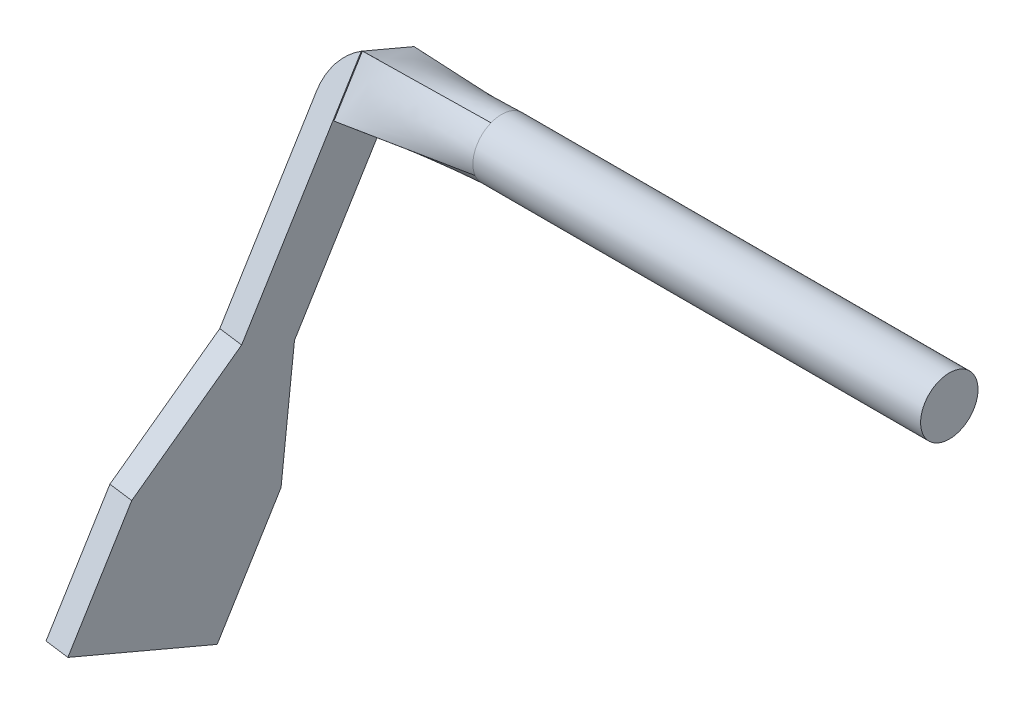
ISO-10303-21;
HEADER;
FILE_DESCRIPTION(('STEP AP214'),'2;1');
FILE_NAME('part.step','',(''),(''),'','','');
FILE_SCHEMA(('AUTOMOTIVE_DESIGN { 1 0 10303 214 1 1 1 1 }'));
ENDSEC;
DATA;
#1=APPLICATION_CONTEXT('core data for automotive mechanical design processes');
#2=APPLICATION_PROTOCOL_DEFINITION('international standard','automotive_design',2000,#1);
#3=PRODUCT_CONTEXT('',#1,'mechanical');
#4=PRODUCT('Part','Part','',(#3));
#5=PRODUCT_RELATED_PRODUCT_CATEGORY('part','',(#4));
#6=PRODUCT_DEFINITION_FORMATION('','',#4);
#7=PRODUCT_DEFINITION_CONTEXT('part definition',#1,'design');
#8=PRODUCT_DEFINITION('design','',#6,#7);
#9=PRODUCT_DEFINITION_SHAPE('','',#8);
#10=(LENGTH_UNIT() NAMED_UNIT(*) SI_UNIT(.MILLI.,.METRE.));
#11=(NAMED_UNIT(*) PLANE_ANGLE_UNIT() SI_UNIT($,.RADIAN.));
#12=(NAMED_UNIT(*) SI_UNIT($,.STERADIAN.) SOLID_ANGLE_UNIT());
#13=UNCERTAINTY_MEASURE_WITH_UNIT(LENGTH_MEASURE(1.E-05),#10,'distance_accuracy_value','');
#14=(GEOMETRIC_REPRESENTATION_CONTEXT(3) GLOBAL_UNCERTAINTY_ASSIGNED_CONTEXT((#13)) GLOBAL_UNIT_ASSIGNED_CONTEXT((#10,
#11,#12)) REPRESENTATION_CONTEXT('',''));
#15=CARTESIAN_POINT('',(0.,0.,0.));
#16=DIRECTION('',(0.,0.,1.));
#17=DIRECTION('',(1.,0.,0.));
#18=AXIS2_PLACEMENT_3D('',#15,#16,#17);
#19=CARTESIAN_POINT('',(-38.7890360234682,7.20091431639173,291.776424918787));
#20=DIRECTION('',(0.107904429239592,0.915130275715374,-0.388449755592125));
#21=DIRECTION('',(0.,0.390731128489271,0.920504853452442));
#22=AXIS2_PLACEMENT_3D('',#19,#20,#21);
#23=PLANE('',#22);
#24=DIRECTION('',(0.,0.390731128489271,0.920504853452441));
#25=VECTOR('',#24,1.);
#26=CARTESIAN_POINT('',(-36.8007134800658,7.00226121474362,291.860748157598));
#27=LINE('',#26,#25);
#28=CARTESIAN_POINT('',(-36.8007134800658,7.00226121474362,291.860748157598));
#29=VERTEX_POINT('',#28);
#30=CARTESIAN_POINT('',(-36.8007134800659,12.5228475029577,304.866434425422));
#31=VERTEX_POINT('',#30);
#32=EDGE_CURVE('E268',#29,#31,#27,.T.);
#33=ORIENTED_EDGE('',*,*,#32,.T.);
#34=DIRECTION('',(0.994161271701165,-0.099326550824059,0.0421616194057801));
#35=VECTOR('',#34,1.);
#36=CARTESIAN_POINT('',(-38.7890360234682,12.7215006046059,304.78211118661));
#37=LINE('',#36,#35);
#38=CARTESIAN_POINT('',(-38.7890360234682,12.7215006046059,304.78211118661));
#39=VERTEX_POINT('',#38);
#40=EDGE_CURVE('E271',#39,#31,#37,.T.);
#41=ORIENTED_EDGE('',*,*,#40,.F.);
#42=DIRECTION('',(0.,0.390731128489271,0.920504853452441));
#43=VECTOR('',#42,1.);
#44=CARTESIAN_POINT('',(-38.7890360234682,7.20091431639173,291.776424918787));
#45=LINE('',#44,#43);
#46=CARTESIAN_POINT('',(-38.7890360234682,7.20091431639173,291.776424918787));
#47=VERTEX_POINT('',#46);
#48=EDGE_CURVE('E291',#47,#39,#45,.T.);
#49=ORIENTED_EDGE('',*,*,#48,.F.);
#50=DIRECTION('',(0.994161271701165,-0.099326550824059,0.0421616194057801));
#51=VECTOR('',#50,1.);
#52=CARTESIAN_POINT('',(-38.7890360234682,7.20091431639173,291.776424918787));
#53=LINE('',#52,#51);
#54=EDGE_CURVE('E273',#47,#29,#53,.T.);
#55=ORIENTED_EDGE('',*,*,#54,.T.);
#56=EDGE_LOOP('',(#33,#41,#49,#55));
#57=FACE_BOUND('',#56,.T.);
#58=ADVANCED_FACE('F43',(#57),#23,.F.);
#59=CARTESIAN_POINT('',(-38.7890360234682,12.7215006046059,304.78211118661));
#60=DIRECTION('',(0.,-0.390731128489269,-0.920504853452442));
#61=DIRECTION('',(0.,0.920504853452442,-0.390731128489269));
#62=AXIS2_PLACEMENT_3D('',#59,#60,#61);
#63=PLANE('',#62);
#64=DIRECTION('',(0.107904429239593,0.915130275715375,-0.388449755592123));
#65=VECTOR('',#64,1.);
#66=CARTESIAN_POINT('',(-36.8007134800659,12.5228475029577,304.866434425422));
#67=LINE('',#66,#65);
#68=CARTESIAN_POINT('',(-35.5906103790929,22.785651284428,300.510132676487));
#69=VERTEX_POINT('',#68);
#70=EDGE_CURVE('E275',#31,#69,#67,.T.);
#71=ORIENTED_EDGE('',*,*,#70,.T.);
#72=DIRECTION('',(0.994161271701165,-0.099326550824059,0.0421616194057801));
#73=VECTOR('',#72,1.);
#74=CARTESIAN_POINT('',(-37.5789329224952,22.9843043860761,300.425809437675));
#75=LINE('',#74,#73);
#76=CARTESIAN_POINT('',(-37.5789329224952,22.9843043860761,300.425809437675));
#77=VERTEX_POINT('',#76);
#78=EDGE_CURVE('E302',#77,#69,#75,.T.);
#79=ORIENTED_EDGE('',*,*,#78,.F.);
#80=DIRECTION('',(0.107904429239593,0.915130275715375,-0.388449755592123));
#81=VECTOR('',#80,1.);
#82=CARTESIAN_POINT('',(-38.7890360234682,12.7215006046059,304.78211118661));
#83=LINE('',#82,#81);
#84=EDGE_CURVE('E321',#39,#77,#83,.T.);
#85=ORIENTED_EDGE('',*,*,#84,.F.);
#86=ORIENTED_EDGE('',*,*,#40,.T.);
#87=EDGE_LOOP('',(#71,#79,#85,#86));
#88=FACE_BOUND('',#87,.T.);
#89=ADVANCED_FACE('F255',(#88),#63,.F.);
#90=CARTESIAN_POINT('',(-37.5789329224952,22.9843043860761,300.425809437675));
#91=DIRECTION('',(-0.041952753403164,-0.715788508678569,-0.697055792118252));
#92=DIRECTION('',(0.,0.69767002381762,-0.71641924727517));
#93=AXIS2_PLACEMENT_3D('',#90,#91,#92);
#94=PLANE('',#93);
#95=DIRECTION('',(0.0994149502409748,0.691217076716936,-0.715776236350075));
#96=VECTOR('',#95,1.);
#97=CARTESIAN_POINT('',(-35.5906103790929,22.785651284428,300.510132676487));
#98=LINE('',#97,#96);
#99=CARTESIAN_POINT('',(-34.4234859486809,30.9004905012534,292.106970675927));
#100=VERTEX_POINT('',#99);
#101=EDGE_CURVE('E278',#69,#100,#98,.T.);
#102=ORIENTED_EDGE('',*,*,#101,.T.);
#103=DIRECTION('',(0.994161271701165,-0.099326550824059,0.0421616194057801));
#104=VECTOR('',#103,1.);
#105=CARTESIAN_POINT('',(-36.411808492083,31.0991436029038,292.022647437114));
#106=LINE('',#105,#104);
#107=CARTESIAN_POINT('',(-36.411808492083,31.0991436029038,292.022647437114));
#108=VERTEX_POINT('',#107);
#109=EDGE_CURVE('E299',#108,#100,#106,.T.);
#110=ORIENTED_EDGE('',*,*,#109,.F.);
#111=DIRECTION('',(0.0994149502409748,0.691217076716936,-0.715776236350075));
#112=VECTOR('',#111,1.);
#113=CARTESIAN_POINT('',(-37.5789329224952,22.9843043860761,300.425809437675));
#114=LINE('',#113,#112);
#115=EDGE_CURVE('E323',#77,#108,#114,.T.);
#116=ORIENTED_EDGE('',*,*,#115,.F.);
#117=ORIENTED_EDGE('',*,*,#78,.T.);
#118=EDGE_LOOP('',(#102,#110,#116,#117));
#119=FACE_BOUND('',#118,.T.);
#120=ADVANCED_FACE('F251',(#119),#94,.F.);
#121=CARTESIAN_POINT('',(-37.5789329224951,17.463718097862,287.420123169852));
#122=DIRECTION('',(-0.0419527534031707,0.00419149529530913,0.999110803589413));
#123=DIRECTION('',(0.99911958021048,0.,0.0419531219342866));
#124=AXIS2_PLACEMENT_3D('',#121,#122,#123);
#125=PLANE('',#124);
#126=DIRECTION('',(-0.0994149502409721,-0.995046063088833,0.));
#127=VECTOR('',#126,1.);
#128=CARTESIAN_POINT('',(-35.5906103790928,17.2650649962139,287.504446408663));
#129=LINE('',#128,#127);
#130=CARTESIAN_POINT('',(-34.4234859486806,28.9468348588093,287.504446408663));
#131=VERTEX_POINT('',#130);
#132=CARTESIAN_POINT('',(-35.5906103790928,17.2650649962139,287.504446408663));
#133=VERTEX_POINT('',#132);
#134=EDGE_CURVE('E287',#131,#133,#129,.T.);
#135=ORIENTED_EDGE('',*,*,#134,.T.);
#136=DIRECTION('',(0.994161271701165,-0.099326550824059,0.0421616194057801));
#137=VECTOR('',#136,1.);
#138=CARTESIAN_POINT('',(-37.5789329224951,17.463718097862,287.420123169852));
#139=LINE('',#138,#137);
#140=CARTESIAN_POINT('',(-37.5789329224951,17.463718097862,287.420123169852));
#141=VERTEX_POINT('',#140);
#142=EDGE_CURVE('E293',#141,#133,#139,.T.);
#143=ORIENTED_EDGE('',*,*,#142,.F.);
#144=DIRECTION('',(-0.0994149502409721,-0.995046063088833,0.));
#145=VECTOR('',#144,1.);
#146=CARTESIAN_POINT('',(-37.5789329224951,17.463718097862,287.420123169852));
#147=LINE('',#146,#145);
#148=CARTESIAN_POINT('',(-36.411808492083,29.1454879604574,287.420123169852));
#149=VERTEX_POINT('',#148);
#150=EDGE_CURVE('E325',#149,#141,#147,.T.);
#151=ORIENTED_EDGE('',*,*,#150,.F.);
#152=DIRECTION('',(0.994161271701165,-0.099326550824059,0.0421616194057801));
#153=VECTOR('',#152,1.);
#154=CARTESIAN_POINT('',(-36.411808492083,29.1454879604574,287.420123169852));
#155=LINE('',#154,#153);
#156=EDGE_CURVE('E296',#149,#131,#155,.T.);
#157=ORIENTED_EDGE('',*,*,#156,.T.);
#158=EDGE_LOOP('',(#135,#143,#151,#157));
#159=FACE_BOUND('',#158,.T.);
#160=ADVANCED_FACE('F247',(#159),#125,.F.);
#161=CARTESIAN_POINT('',(-37.5789329224951,17.463718097862,287.420123169852));
#162=DIRECTION('',(0.,0.390731128489269,0.920504853452442));
#163=DIRECTION('',(0.,-0.920504853452442,0.390731128489269));
#164=AXIS2_PLACEMENT_3D('',#161,#162,#163);
#165=PLANE('',#164);
#166=DIRECTION('',(-0.107904429239592,-0.915130275715375,0.388449755592122));
#167=VECTOR('',#166,1.);
#168=CARTESIAN_POINT('',(-35.5906103790928,17.2650649962139,287.504446408663));
#169=LINE('',#168,#167);
#170=EDGE_CURVE('E289',#133,#29,#169,.T.);
#171=ORIENTED_EDGE('',*,*,#170,.T.);
#172=ORIENTED_EDGE('',*,*,#54,.F.);
#173=DIRECTION('',(-0.107904429239592,-0.915130275715375,0.388449755592122));
#174=VECTOR('',#173,1.);
#175=CARTESIAN_POINT('',(-37.5789329224951,17.463718097862,287.420123169852));
#176=LINE('',#175,#174);
#177=EDGE_CURVE('E283',#141,#47,#176,.T.);
#178=ORIENTED_EDGE('',*,*,#177,.F.);
#179=ORIENTED_EDGE('',*,*,#142,.T.);
#180=EDGE_LOOP('',(#171,#172,#178,#179));
#181=FACE_BOUND('',#180,.T.);
#182=ADVANCED_FACE('F240',(#181),#165,.F.);
#183=CARTESIAN_POINT('',(-26.818527057969,2.67943629134899,-1.13735322731581));
#184=DIRECTION('',(-0.994161271701165,0.0993265508240592,-0.0421616194057804));
#185=DIRECTION('',(-0.0994149502409721,-0.995046063088833,0.));
#186=AXIS2_PLACEMENT_3D('',#183,#184,#185);
#187=PLANE('',#186);
#188=DIRECTION('',(-0.107904429239593,-0.915130275715377,0.388449755592118));
#189=VECTOR('',#188,1.);
#190=CARTESIAN_POINT('',(-34.1458154780518,50.3168793929244,283.86520256968));
#191=LINE('',#190,#189);
#192=CARTESIAN_POINT('',(-34.5774331950102,46.6563582900629,285.419001592049));
#193=VERTEX_POINT('',#192);
#194=EDGE_CURVE('E358',#193,#108,#191,.T.);
#195=ORIENTED_EDGE('',*,*,#194,.F.);
#196=DIRECTION('',(0.,-0.390731128489268,-0.920504853452443));
#197=VECTOR('',#196,1.);
#198=CARTESIAN_POINT('',(-34.5774331950102,44.7027026476166,280.816477324787));
#199=LINE('',#198,#197);
#200=CARTESIAN_POINT('',(-34.5774331950102,44.7027026476166,280.816477324787));
#201=VERTEX_POINT('',#200);
#202=EDGE_CURVE('E54',#193,#201,#199,.T.);
#203=ORIENTED_EDGE('',*,*,#202,.T.);
#204=DIRECTION('',(-0.107904429239593,-0.915130275715377,0.388449755592118));
#205=VECTOR('',#204,1.);
#206=CARTESIAN_POINT('',(-34.1458154780518,48.3632237504781,279.262678302418));
#207=LINE('',#206,#205);
#208=EDGE_CURVE('E312',#201,#149,#207,.T.);
#209=ORIENTED_EDGE('',*,*,#208,.T.);
#210=ORIENTED_EDGE('',*,*,#150,.T.);
#211=ORIENTED_EDGE('',*,*,#177,.T.);
#212=ORIENTED_EDGE('',*,*,#48,.T.);
#213=ORIENTED_EDGE('',*,*,#84,.T.);
#214=ORIENTED_EDGE('',*,*,#115,.T.);
#215=EDGE_LOOP('',(#195,#203,#209,#210,#211,#212,#213,#214));
#216=FACE_BOUND('',#215,.T.);
#217=ADVANCED_FACE('F237',(#216),#187,.T.);
#218=CARTESIAN_POINT('',(-24.8302045145666,2.48078318970087,-1.05302998850425));
#219=DIRECTION('',(-0.994161271701165,0.0993265508240592,-0.0421616194057804));
#220=DIRECTION('',(-0.0994149502409721,-0.995046063088833,0.));
#221=AXIS2_PLACEMENT_3D('',#218,#219,#220);
#222=PLANE('',#221);
#223=DIRECTION('',(0.,-0.390731128489274,-0.92050485345244));
#224=VECTOR('',#223,1.);
#225=CARTESIAN_POINT('',(-32.6970150808475,45.5011549177807,285.794195193431));
#226=LINE('',#225,#224);
#227=CARTESIAN_POINT('',(-32.6970150808475,45.5011549177807,285.794195193431));
#228=VERTEX_POINT('',#227);
#229=CARTESIAN_POINT('',(-32.6970150808475,43.5889192702531,281.289250319191));
#230=VERTEX_POINT('',#229);
#231=EDGE_CURVE('E343',#228,#230,#226,.T.);
#232=ORIENTED_EDGE('',*,*,#231,.F.);
#233=DIRECTION('',(-0.107904429239594,-0.915130275715374,0.388449755592123));
#234=VECTOR('',#233,1.);
#235=CARTESIAN_POINT('',(-32.1574929346495,50.0768062963576,283.85194641547));
#236=LINE('',#235,#234);
#237=CARTESIAN_POINT('',(-32.1574929346495,50.0768062963576,283.85194641547));
#238=VERTEX_POINT('',#237);
#239=EDGE_CURVE('E346',#238,#228,#236,.T.);
#240=ORIENTED_EDGE('',*,*,#239,.F.);
#241=DIRECTION('',(0.,-0.390731128489268,-0.920504853452443));
#242=VECTOR('',#241,1.);
#243=CARTESIAN_POINT('',(-32.1574929346495,50.1182262912763,283.949525808492));
#244=LINE('',#243,#242);
#245=CARTESIAN_POINT('',(-32.1574929346495,50.1182262912763,283.949525808492));
#246=VERTEX_POINT('',#245);
#247=EDGE_CURVE('E140',#246,#238,#244,.T.);
#248=ORIENTED_EDGE('',*,*,#247,.F.);
#249=DIRECTION('',(-0.107904429239593,-0.915130275715377,0.388449755592118));
#250=VECTOR('',#249,1.);
#251=CARTESIAN_POINT('',(-32.1574929346495,50.1182262912763,283.949525808492));
#252=LINE('',#251,#250);
#253=EDGE_CURVE('E276',#246,#100,#252,.T.);
#254=ORIENTED_EDGE('',*,*,#253,.T.);
#255=ORIENTED_EDGE('',*,*,#101,.F.);
#256=ORIENTED_EDGE('',*,*,#70,.F.);
#257=ORIENTED_EDGE('',*,*,#32,.F.);
#258=ORIENTED_EDGE('',*,*,#170,.F.);
#259=ORIENTED_EDGE('',*,*,#134,.F.);
#260=DIRECTION('',(-0.107904429239593,-0.915130275715377,0.388449755592118));
#261=VECTOR('',#260,1.);
#262=CARTESIAN_POINT('',(-32.1574929346495,48.16457064883,279.34700154123));
#263=LINE('',#262,#261);
#264=EDGE_CURVE('E309',#230,#131,#263,.T.);
#265=ORIENTED_EDGE('',*,*,#264,.F.);
#266=EDGE_LOOP('',(#232,#240,#248,#254,#255,#256,#257,#258,#259,#265));
#267=FACE_BOUND('',#266,.T.);
#268=ADVANCED_FACE('F235',(#267),#222,.F.);
#269=CARTESIAN_POINT('',(-34.1458154780518,50.3168793929244,283.86520256968));
#270=DIRECTION('',(0.,-0.390731128489266,-0.920504853452444));
#271=DIRECTION('',(0.,0.920504853452444,-0.390731128489266));
#272=AXIS2_PLACEMENT_3D('',#269,#270,#271);
#273=PLANE('',#272);
#274=ORIENTED_EDGE('',*,*,#253,.F.);
#275=CARTESIAN_POINT('',(-29.6066268365044,46.1597255359426,285.629809689078));
#276=DIRECTION('',(0.,-0.390731128489266,-0.920504853452444));
#277=DIRECTION('',(0.,0.920504853452444,-0.390731128489266));
#278=AXIS2_PLACEMENT_3D('',#275,#276,#277);
#279=CIRCLE('',#278,5.);
#280=EDGE_CURVE('E306',#246,#193,#279,.F.);
#281=ORIENTED_EDGE('',*,*,#280,.T.);
#282=ORIENTED_EDGE('',*,*,#194,.T.);
#283=ORIENTED_EDGE('',*,*,#109,.T.);
#284=EDGE_LOOP('',(#274,#281,#282,#283));
#285=FACE_BOUND('',#284,.T.);
#286=ADVANCED_FACE('F231',(#285),#273,.F.);
#287=CARTESIAN_POINT('',(-32.1574929346495,48.16457064883,279.34700154123));
#288=DIRECTION('',(0.,0.390731128489263,0.920504853452445));
#289=DIRECTION('',(0.,-0.920504853452445,0.390731128489263));
#290=AXIS2_PLACEMENT_3D('',#287,#288,#289);
#291=PLANE('',#290);
#292=ORIENTED_EDGE('',*,*,#208,.F.);
#293=CARTESIAN_POINT('',(-29.6066268365043,44.2060698934962,281.027285421816));
#294=DIRECTION('',(0.,0.390731128489263,0.920504853452445));
#295=DIRECTION('',(0.,-0.920504853452445,0.390731128489263));
#296=AXIS2_PLACEMENT_3D('',#293,#294,#295);
#297=CIRCLE('',#296,5.);
#298=CARTESIAN_POINT('',(-32.1574929346491,48.16457064883,279.34700154123));
#299=VERTEX_POINT('',#298);
#300=EDGE_CURVE('E11',#201,#299,#297,.F.);
#301=ORIENTED_EDGE('',*,*,#300,.T.);
#302=DIRECTION('',(-0.107904429239592,-0.915130275715377,0.388449755592118));
#303=VECTOR('',#302,1.);
#304=CARTESIAN_POINT('',(-32.1574929346495,48.16457064883,279.34700154123));
#305=LINE('',#304,#303);
#306=EDGE_CURVE('E151',#299,#230,#305,.T.);
#307=ORIENTED_EDGE('',*,*,#306,.T.);
#308=ORIENTED_EDGE('',*,*,#264,.T.);
#309=ORIENTED_EDGE('',*,*,#156,.F.);
#310=EDGE_LOOP('',(#292,#301,#307,#308,#309));
#311=FACE_BOUND('',#310,.T.);
#312=ADVANCED_FACE('F223',(#311),#291,.F.);
#313=CARTESIAN_POINT('',(-29.6066268365032,-63.6199625074653,27.0050718926178));
#314=DIRECTION('',(0.,0.390731128489268,0.920504853452442));
#315=DIRECTION('',(0.,-0.920504853452443,0.390731128489269));
#316=AXIS2_PLACEMENT_3D('',#313,#314,#315);
#317=CYLINDRICAL_SURFACE('',#316,5.);
#318=ORIENTED_EDGE('',*,*,#300,.F.);
#319=ORIENTED_EDGE('',*,*,#202,.F.);
#320=ORIENTED_EDGE('',*,*,#280,.F.);
#321=ORIENTED_EDGE('',*,*,#247,.T.);
#322=DIRECTION('',(0.,0.390731128489231,0.920504853452459));
#323=VECTOR('',#322,1.);
#324=CARTESIAN_POINT('',(-32.1574929346495,50.0768062963576,283.85194641547));
#325=LINE('',#324,#323);
#326=EDGE_CURVE('E345',#299,#238,#325,.T.);
#327=ORIENTED_EDGE('',*,*,#326,.F.);
#328=EDGE_LOOP('',(#318,#319,#320,#321,#327));
#329=FACE_BOUND('',#328,.T.);
#330=ADVANCED_FACE('F45',(#329),#317,.T.);
#331=CARTESIAN_POINT('',(-32.1574929346495,50.0768062963576,283.85194641547));
#332=CARTESIAN_POINT('',(-21.5,49.7232134337961,283.306718550008));
#333=CARTESIAN_POINT('',(-32.2024531134994,49.6955020148095,284.0138004803));
#334=CARTESIAN_POINT('',(-21.5,49.6141347701034,283.582869143137));
#335=CARTESIAN_POINT('',(-32.2474132923492,49.3141977332614,284.17565454513));
#336=CARTESIAN_POINT('',(-21.5,49.445536510252,283.861201019409));
#337=CARTESIAN_POINT('',(-32.3373336500489,48.5515891701652,284.499362674791));
#338=CARTESIAN_POINT('',(-21.5,48.9865603511272,284.347450111115));
#339=CARTESIAN_POINT('',(-32.3822938288987,48.1702848886171,284.661216739621));
#340=CARTESIAN_POINT('',(-21.5,48.6961023492884,284.553181607394));
#341=CARTESIAN_POINT('',(-32.4722141865984,47.407676325521,284.984924869281));
#342=CARTESIAN_POINT('',(-21.5,48.0536174000272,284.825900288149));
#343=CARTESIAN_POINT('',(-32.5171743654482,47.0263720439729,285.146778934111));
#344=CARTESIAN_POINT('',(-21.5,47.7038574643261,284.891925183241));
#345=CARTESIAN_POINT('',(-32.6070947231478,46.2637634808768,285.470487063771));
#346=CARTESIAN_POINT('',(-21.5,47.035247509006,284.884308000225));
#347=CARTESIAN_POINT('',(-32.6520549019977,45.8824591993287,285.632341128601));
#348=CARTESIAN_POINT('',(-21.5,46.7179141202506,284.812241871186));
#349=CARTESIAN_POINT('',(-32.6970150808475,45.5011549177807,285.794195193431));
#350=CARTESIAN_POINT('',(-21.5,46.4434956009533,284.698876174324));
#351=B_SPLINE_SURFACE_WITH_KNOTS('',3,1,((#331,#332),(#333,#334),(#335,#336),(#337,#338),(#339,
#340),(#341,#342),(#343,#344),(#345,#346),(#347,#348),(#349,#350)),.UNSPECIFIED.,.F.,.F.,.F.,(4,
2,2,2,4),(2,2),(0.,0.25,0.5,0.75,1.),(0.,1.),.UNSPECIFIED.);
#352=DIRECTION('',(0.991776498634803,0.0834679007333563,-0.0970179689689347));
#353=VECTOR('',#352,1.);
#354=CARTESIAN_POINT('',(-27.0985075404237,45.972325259367,285.246535683877));
#355=LINE('',#354,#353);
#356=CARTESIAN_POINT('',(-21.5,46.4434956009533,284.698876174324));
#357=VERTEX_POINT('',#356);
#358=EDGE_CURVE('E62',#228,#357,#355,.T.);
#359=CARTESIAN_POINT('',(-21.5,47.3980320534347,282.388278814141));
#360=DIRECTION('',(1.,0.,0.));
#361=DIRECTION('',(0.,0.,-1.));
#362=AXIS2_PLACEMENT_3D('',#359,#360,#361);
#363=CIRCLE('',#362,2.50000000000002);
#364=CARTESIAN_POINT('',(-21.5,49.7232240685998,283.306722770029));
#365=VERTEX_POINT('',#364);
#366=EDGE_CURVE('E47',#365,#357,#363,.T.);
#367=DIRECTION('',(-0.998146155191497,0.0331163584562606,0.051064270082204));
#368=VECTOR('',#367,1.);
#369=CARTESIAN_POINT('',(-26.8287464673248,49.9000098650768,283.579332482739));
#370=LINE('',#369,#368);
#371=EDGE_CURVE('E135',#365,#238,#370,.T.);
#372=ORIENTED_EDGE('',*,*,#239,.T.);
#373=ORIENTED_EDGE('',*,*,#358,.T.);
#374=ORIENTED_EDGE('',*,*,#366,.F.);
#375=ORIENTED_EDGE('',*,*,#371,.T.);
#376=EDGE_LOOP('',(#372,#373,#374,#375));
#377=FACE_BOUND('',#376,.T.);
#378=ADVANCED_FACE('F180',(#377),#351,.T.);
#379=CARTESIAN_POINT('',(-32.6970150808475,45.5011549177807,285.794195193431));
#380=CARTESIAN_POINT('',(-21.5,46.4434956009533,284.698876174324));
#381=CARTESIAN_POINT('',(-32.6970150808475,45.3418019471533,285.418783120577));
#382=CARTESIAN_POINT('',(-21.5,46.173317608877,284.587262291897));
#383=CARTESIAN_POINT('',(-32.6970150808475,45.1824489765259,285.043371047724));
#384=CARTESIAN_POINT('',(-21.5,45.9024321265087,284.418186906408));
#385=CARTESIAN_POINT('',(-32.6970150808475,44.8637430352713,284.292546902017));
#386=CARTESIAN_POINT('',(-21.5,45.4298651710489,283.964243638479));
#387=CARTESIAN_POINT('',(-32.6970150808475,44.7043900646439,283.917134829164));
#388=CARTESIAN_POINT('',(-21.5,45.2301589238934,283.679351436224));
#389=CARTESIAN_POINT('',(-32.6970150808475,44.3856841233893,283.166310683457));
#390=CARTESIAN_POINT('',(-21.5,44.9633809157137,283.050861834504));
#391=CARTESIAN_POINT('',(-32.6970150808475,44.2263311527621,282.790898610603));
#392=CARTESIAN_POINT('',(-21.5,44.8971742320447,282.709302429574));
#393=CARTESIAN_POINT('',(-32.6970150808475,43.9076252115075,282.040074464897));
#394=CARTESIAN_POINT('',(-21.5,44.8989073635404,282.054030719406));
#395=CARTESIAN_POINT('',(-32.6970150808475,43.7482722408803,281.664662392044));
#396=CARTESIAN_POINT('',(-21.5,44.9654575772635,281.741722378836));
#397=CARTESIAN_POINT('',(-32.6970150808475,43.5889192702531,281.289250319191));
#398=CARTESIAN_POINT('',(-21.5,45.0728506730732,281.469839078273));
#399=B_SPLINE_SURFACE_WITH_KNOTS('',3,1,((#379,#380),(#381,#382),(#383,#384),(#385,#386),(#387,
#388),(#389,#390),(#391,#392),(#393,#394),(#395,#396),(#397,#398)),.UNSPECIFIED.,.F.,.F.,.F.,(4,
2,2,2,4),(2,2),(0.,0.25,0.5,0.75,1.),(0.,1.),.UNSPECIFIED.);
#400=DIRECTION('',(0.991205339850088,0.131363646456324,0.0159864518380181));
#401=VECTOR('',#400,1.);
#402=CARTESIAN_POINT('',(-27.0985075404237,44.3308849716631,281.379544698732));
#403=LINE('',#402,#401);
#404=CARTESIAN_POINT('',(-21.5,45.0728400382662,281.469834858251));
#405=VERTEX_POINT('',#404);
#406=EDGE_CURVE('E152',#230,#405,#403,.T.);
#407=EDGE_CURVE('E158',#357,#405,#363,.T.);
#408=ORIENTED_EDGE('',*,*,#231,.T.);
#409=ORIENTED_EDGE('',*,*,#406,.T.);
#410=ORIENTED_EDGE('',*,*,#407,.F.);
#411=ORIENTED_EDGE('',*,*,#358,.F.);
#412=EDGE_LOOP('',(#408,#409,#410,#411));
#413=FACE_BOUND('',#412,.T.);
#414=ADVANCED_FACE('F186',(#413),#399,.T.);
#415=CARTESIAN_POINT('',(-32.1574929346495,48.1645706488301,279.34700154123));
#416=CARTESIAN_POINT('',(-21.5,48.352568505916,280.077681453958));
#417=CARTESIAN_POINT('',(-32.1574929346495,48.3239236194574,279.722413614083));
#418=CARTESIAN_POINT('',(-21.5,48.6227464979923,280.189295336385));
#419=CARTESIAN_POINT('',(-32.1574929346495,48.4832765900847,280.097825686937));
#420=CARTESIAN_POINT('',(-21.5,48.8936319803606,280.358370721874));
#421=CARTESIAN_POINT('',(-32.1574929346495,48.8019825313393,280.848649832643));
#422=CARTESIAN_POINT('',(-21.5,49.3661989358205,280.812313989802));
#423=CARTESIAN_POINT('',(-32.1574929346495,48.9613355019666,281.224061905497));
#424=CARTESIAN_POINT('',(-21.5,49.565905182976,281.097206192058));
#425=CARTESIAN_POINT('',(-32.1574929346495,49.2800414432211,281.974886051203));
#426=CARTESIAN_POINT('',(-21.5,49.8326831911556,281.725695793778));
#427=CARTESIAN_POINT('',(-32.1574929346495,49.4393944138484,282.350298124057));
#428=CARTESIAN_POINT('',(-21.5,49.8988898748246,282.067255198708));
#429=CARTESIAN_POINT('',(-32.1574929346495,49.758100355103,283.101122269764));
#430=CARTESIAN_POINT('',(-21.5,49.8971567433289,282.722526908875));
#431=CARTESIAN_POINT('',(-32.1574929346495,49.9174533257303,283.476534342617));
#432=CARTESIAN_POINT('',(-21.5,49.8306065296058,283.034835249445));
#433=CARTESIAN_POINT('',(-32.1574929346495,50.0768062963576,283.85194641547));
#434=CARTESIAN_POINT('',(-21.5,49.7232134337961,283.306718550008));
#435=B_SPLINE_SURFACE_WITH_KNOTS('',3,1,((#415,#416),(#417,#418),(#419,#420),(#421,#422),(#423,
#424),(#425,#426),(#427,#428),(#429,#430),(#431,#432),(#433,#434)),.UNSPECIFIED.,.F.,.F.,.F.,(4,
2,2,2,4),(2,2),(0.,0.25,0.5,0.75,1.),(0.,1.),.UNSPECIFIED.);
#436=CARTESIAN_POINT('',(-21.5,48.3525686468838,280.077681109745));
#437=VERTEX_POINT('',#436);
#438=EDGE_CURVE('E128',#437,#365,#363,.T.);
#439=DIRECTION('',(0.997503544442781,0.0175959327339685,0.0683890486504282));
#440=VECTOR('',#439,1.);
#441=CARTESIAN_POINT('',(-26.8287464673247,48.2585695773731,279.712341497594));
#442=LINE('',#441,#440);
#443=EDGE_CURVE('E133',#299,#437,#442,.T.);
#444=ORIENTED_EDGE('',*,*,#326,.T.);
#445=ORIENTED_EDGE('',*,*,#371,.F.);
#446=ORIENTED_EDGE('',*,*,#438,.F.);
#447=ORIENTED_EDGE('',*,*,#443,.F.);
#448=EDGE_LOOP('',(#444,#445,#446,#447));
#449=FACE_BOUND('',#448,.T.);
#450=ADVANCED_FACE('F132',(#449),#435,.T.);
#451=CARTESIAN_POINT('',(-32.6970150808475,43.5889192702531,281.289250319191));
#452=CARTESIAN_POINT('',(-21.5,45.0728506730732,281.469839078273));
#453=CARTESIAN_POINT('',(-32.6520549019976,43.9702235518011,281.127396254361));
#454=CARTESIAN_POINT('',(-21.5,45.1819293367659,281.193688485144));
#455=CARTESIAN_POINT('',(-32.6070947231478,44.3515278333492,280.96554218953));
#456=CARTESIAN_POINT('',(-21.5,45.3505275966173,280.915356608873));
#457=CARTESIAN_POINT('',(-32.5171743654482,45.1141363964453,280.64183405987));
#458=CARTESIAN_POINT('',(-21.5,45.809503755742,280.429107517166));
#459=CARTESIAN_POINT('',(-32.4722141865983,45.4954406779934,280.47997999504));
#460=CARTESIAN_POINT('',(-21.5,46.0999617575809,280.223376020887));
#461=CARTESIAN_POINT('',(-32.3822938288987,46.2580492410896,280.15627186538));
#462=CARTESIAN_POINT('',(-21.5,46.7424467068421,279.950657340132));
#463=CARTESIAN_POINT('',(-32.3373336500488,46.6393535226377,279.99441780055));
#464=CARTESIAN_POINT('',(-21.5,47.0922066425432,279.88463244504));
#465=CARTESIAN_POINT('',(-32.2474132923492,47.4019620857339,279.67070967089));
#466=CARTESIAN_POINT('',(-21.5,47.7608165978633,279.892249628057));
#467=CARTESIAN_POINT('',(-32.2024531134993,47.783266367282,279.50885560606));
#468=CARTESIAN_POINT('',(-21.5,48.0781499866188,279.964315757096));
#469=CARTESIAN_POINT('',(-32.1574929346495,48.1645706488301,279.34700154123));
#470=CARTESIAN_POINT('',(-21.5,48.352568505916,280.077681453958));
#471=B_SPLINE_SURFACE_WITH_KNOTS('',3,1,((#451,#452),(#453,#454),(#455,#456),(#457,#458),(#459,
#460),(#461,#462),(#463,#464),(#465,#466),(#467,#468),(#469,#470)),.UNSPECIFIED.,.F.,.F.,.F.,(4,
2,2,2,4),(2,2),(0.,0.25,0.5,0.75,1.),(0.,1.),.UNSPECIFIED.);
#472=EDGE_CURVE('E147',#405,#437,#363,.T.);
#473=ORIENTED_EDGE('',*,*,#306,.F.);
#474=ORIENTED_EDGE('',*,*,#443,.T.);
#475=ORIENTED_EDGE('',*,*,#472,.F.);
#476=ORIENTED_EDGE('',*,*,#406,.F.);
#477=EDGE_LOOP('',(#473,#474,#475,#476));
#478=FACE_BOUND('',#477,.T.);
#479=ADVANCED_FACE('F145',(#478),#471,.T.);
#480=CARTESIAN_POINT('',(-21.5,47.3980320534347,282.388278814141));
#481=DIRECTION('',(1.,0.,0.));
#482=DIRECTION('',(0.,0.,-1.));
#483=AXIS2_PLACEMENT_3D('',#480,#481,#482);
#484=CYLINDRICAL_SURFACE('',#483,2.50000000000002);
#485=ORIENTED_EDGE('',*,*,#438,.T.);
#486=ORIENTED_EDGE('',*,*,#366,.T.);
#487=ORIENTED_EDGE('',*,*,#407,.T.);
#488=ORIENTED_EDGE('',*,*,#472,.T.);
#489=EDGE_LOOP('',(#485,#486,#487,#488));
#490=FACE_BOUND('',#489,.T.);
#491=CARTESIAN_POINT('',(17.5,47.3980320534347,282.388278814141));
#492=DIRECTION('',(1.,0.,0.));
#493=DIRECTION('',(0.,0.,-1.));
#494=AXIS2_PLACEMENT_3D('',#491,#492,#493);
#495=CIRCLE('',#494,2.50000000000002);
#496=CARTESIAN_POINT('',(17.5,47.3980320534347,279.888278814141));
#497=VERTEX_POINT('',#496);
#498=EDGE_CURVE('E369',#497,#497,#495,.T.);
#499=ORIENTED_EDGE('',*,*,#498,.F.);
#500=EDGE_LOOP('',(#499));
#501=FACE_BOUND('',#500,.T.);
#502=ADVANCED_FACE('F156',(#490,#501),#484,.T.);
#503=CARTESIAN_POINT('',(17.5,0.,0.));
#504=DIRECTION('',(1.,0.,0.));
#505=DIRECTION('',(0.,0.,-1.));
#506=AXIS2_PLACEMENT_3D('',#503,#504,#505);
#507=PLANE('',#506);
#508=ORIENTED_EDGE('',*,*,#498,.T.);
#509=EDGE_LOOP('',(#508));
#510=FACE_BOUND('',#509,.T.);
#511=ADVANCED_FACE('F179',(#510),#507,.T.);
#512=CLOSED_SHELL('',(#58,#89,#120,#160,#182,#217,#268,#286,#312,#330,#378,#414,#450,#479,#502,#511));
#513=MANIFOLD_SOLID_BREP('B2',#512);
#514=ADVANCED_BREP_SHAPE_REPRESENTATION('',(#18,#513),#14);
#515=SHAPE_DEFINITION_REPRESENTATION(#9,#514);
ENDSEC;
END-ISO-10303-21;
